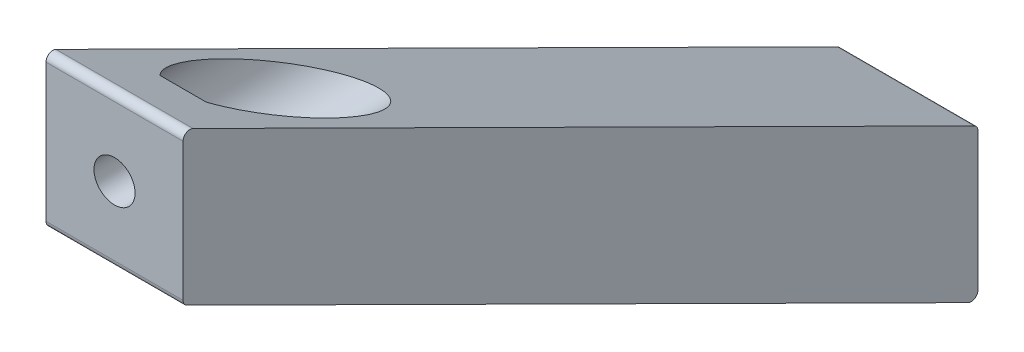
ISO-10303-21;
HEADER;
FILE_DESCRIPTION(('STEP AP214'),'2;1');
FILE_NAME('part.step','',(''),(''),'','','');
FILE_SCHEMA(('AUTOMOTIVE_DESIGN { 1 0 10303 214 1 1 1 1 }'));
ENDSEC;
DATA;
#1=APPLICATION_CONTEXT('core data for automotive mechanical design processes');
#2=APPLICATION_PROTOCOL_DEFINITION('international standard','automotive_design',2000,#1);
#3=PRODUCT_CONTEXT('',#1,'mechanical');
#4=PRODUCT('Part','Part','',(#3));
#5=PRODUCT_RELATED_PRODUCT_CATEGORY('part','',(#4));
#6=PRODUCT_DEFINITION_FORMATION('','',#4);
#7=PRODUCT_DEFINITION_CONTEXT('part definition',#1,'design');
#8=PRODUCT_DEFINITION('design','',#6,#7);
#9=PRODUCT_DEFINITION_SHAPE('','',#8);
#10=(LENGTH_UNIT() NAMED_UNIT(*) SI_UNIT(.MILLI.,.METRE.));
#11=(NAMED_UNIT(*) PLANE_ANGLE_UNIT() SI_UNIT($,.RADIAN.));
#12=(NAMED_UNIT(*) SI_UNIT($,.STERADIAN.) SOLID_ANGLE_UNIT());
#13=UNCERTAINTY_MEASURE_WITH_UNIT(LENGTH_MEASURE(1.E-05),#10,'distance_accuracy_value','');
#14=(GEOMETRIC_REPRESENTATION_CONTEXT(3) GLOBAL_UNCERTAINTY_ASSIGNED_CONTEXT((#13)) GLOBAL_UNIT_ASSIGNED_CONTEXT((#10,
#11,#12)) REPRESENTATION_CONTEXT('',''));
#15=CARTESIAN_POINT('',(0.,0.,0.));
#16=DIRECTION('',(0.,0.,1.));
#17=DIRECTION('',(1.,0.,0.));
#18=AXIS2_PLACEMENT_3D('',#15,#16,#17);
#19=CARTESIAN_POINT('',(20.,45.9089136836522,-115.));
#20=DIRECTION('',(-1.,0.,0.));
#21=DIRECTION('',(0.,0.,1.));
#22=AXIS2_PLACEMENT_3D('',#19,#20,#21);
#23=CYLINDRICAL_SURFACE('',#22,0.999999999999996);
#24=CARTESIAN_POINT('',(0.,45.9089136836522,-115.));
#25=DIRECTION('',(1.,0.,0.));
#26=DIRECTION('',(0.,0.,-1.));
#27=AXIS2_PLACEMENT_3D('',#24,#25,#26);
#28=CIRCLE('',#27,0.999999999999996);
#29=CARTESIAN_POINT('',(0.,45.0134547353029,-114.55485589769));
#30=VERTEX_POINT('',#29);
#31=CARTESIAN_POINT('',(0.,45.9089136836522,-116.));
#32=VERTEX_POINT('',#31);
#33=EDGE_CURVE('E153',#30,#32,#28,.T.);
#34=ORIENTED_EDGE('',*,*,#33,.T.);
#35=DIRECTION('',(-1.,0.,0.));
#36=VECTOR('',#35,1.);
#37=CARTESIAN_POINT('',(20.,45.9089136836522,-116.));
#38=LINE('',#37,#36);
#39=CARTESIAN_POINT('',(20.,45.9089136836522,-116.));
#40=VERTEX_POINT('',#39);
#41=EDGE_CURVE('E210',#40,#32,#38,.T.);
#42=ORIENTED_EDGE('',*,*,#41,.F.);
#43=CARTESIAN_POINT('',(20.,45.9089136836522,-115.));
#44=DIRECTION('',(1.,0.,0.));
#45=DIRECTION('',(0.,0.,-1.));
#46=AXIS2_PLACEMENT_3D('',#43,#44,#45);
#47=CIRCLE('',#46,0.999999999999996);
#48=CARTESIAN_POINT('',(20.,45.0134547353029,-114.55485589769));
#49=VERTEX_POINT('',#48);
#50=EDGE_CURVE('E147',#49,#40,#47,.T.);
#51=ORIENTED_EDGE('',*,*,#50,.F.);
#52=DIRECTION('',(-1.,0.,0.));
#53=VECTOR('',#52,1.);
#54=CARTESIAN_POINT('',(20.,45.0134547353029,-114.55485589769));
#55=LINE('',#54,#53);
#56=EDGE_CURVE('E139',#49,#30,#55,.T.);
#57=ORIENTED_EDGE('',*,*,#56,.T.);
#58=EDGE_LOOP('',(#34,#42,#51,#57));
#59=FACE_BOUND('',#58,.T.);
#60=ADVANCED_FACE('F41',(#59),#23,.T.);
#61=CARTESIAN_POINT('',(20.,45.9089136836522,-116.));
#62=DIRECTION('',(0.,0.,1.));
#63=DIRECTION('',(1.,0.,0.));
#64=AXIS2_PLACEMENT_3D('',#61,#62,#63);
#65=PLANE('',#64);
#66=CARTESIAN_POINT('',(10.,55.9596256862415,-116.));
#67=DIRECTION('',(0.,0.,-1.));
#68=DIRECTION('',(-1.,0.,0.));
#69=AXIS2_PLACEMENT_3D('',#66,#67,#68);
#70=CIRCLE('',#69,3.);
#71=CARTESIAN_POINT('',(7.,55.9596256862415,-116.));
#72=VERTEX_POINT('',#71);
#73=EDGE_CURVE('E120',#72,#72,#70,.T.);
#74=ORIENTED_EDGE('',*,*,#73,.F.);
#75=EDGE_LOOP('',(#74));
#76=FACE_BOUND('',#75,.T.);
#77=DIRECTION('',(0.,1.,0.));
#78=VECTOR('',#77,1.);
#79=CARTESIAN_POINT('',(0.,45.9089136836522,-116.));
#80=LINE('',#79,#78);
#81=CARTESIAN_POINT('',(0.,66.0103376888309,-116.));
#82=VERTEX_POINT('',#81);
#83=EDGE_CURVE('E160',#32,#82,#80,.T.);
#84=ORIENTED_EDGE('',*,*,#83,.T.);
#85=DIRECTION('',(-1.,0.,0.));
#86=VECTOR('',#85,1.);
#87=CARTESIAN_POINT('',(20.,66.0103376888309,-116.));
#88=LINE('',#87,#86);
#89=CARTESIAN_POINT('',(20.,66.0103376888309,-116.));
#90=VERTEX_POINT('',#89);
#91=EDGE_CURVE('E206',#90,#82,#88,.T.);
#92=ORIENTED_EDGE('',*,*,#91,.F.);
#93=DIRECTION('',(0.,1.,0.));
#94=VECTOR('',#93,1.);
#95=CARTESIAN_POINT('',(20.,45.9089136836522,-116.));
#96=LINE('',#95,#94);
#97=EDGE_CURVE('E396',#40,#90,#96,.T.);
#98=ORIENTED_EDGE('',*,*,#97,.F.);
#99=ORIENTED_EDGE('',*,*,#41,.T.);
#100=EDGE_LOOP('',(#84,#92,#98,#99));
#101=FACE_BOUND('',#100,.T.);
#102=ADVANCED_FACE('F233',(#76,#101),#65,.F.);
#103=CARTESIAN_POINT('',(20.,66.0103376888309,-115.));
#104=DIRECTION('',(-1.,0.,0.));
#105=DIRECTION('',(0.,0.,1.));
#106=AXIS2_PLACEMENT_3D('',#103,#104,#105);
#107=CYLINDRICAL_SURFACE('',#106,1.00000000000001);
#108=CARTESIAN_POINT('',(0.,66.0103376888309,-115.));
#109=DIRECTION('',(1.,0.,0.));
#110=DIRECTION('',(0.,0.,-1.));
#111=AXIS2_PLACEMENT_3D('',#108,#109,#110);
#112=CIRCLE('',#111,1.00000000000001);
#113=CARTESIAN_POINT('',(0.,66.9057966371802,-115.44514410231));
#114=VERTEX_POINT('',#113);
#115=EDGE_CURVE('E167',#82,#114,#112,.T.);
#116=ORIENTED_EDGE('',*,*,#115,.T.);
#117=DIRECTION('',(-1.,0.,0.));
#118=VECTOR('',#117,1.);
#119=CARTESIAN_POINT('',(20.,66.9057966371802,-115.44514410231));
#120=LINE('',#119,#118);
#121=CARTESIAN_POINT('',(20.,66.9057966371802,-115.44514410231));
#122=VERTEX_POINT('',#121);
#123=EDGE_CURVE('E202',#122,#114,#120,.T.);
#124=ORIENTED_EDGE('',*,*,#123,.F.);
#125=CARTESIAN_POINT('',(20.,66.0103376888309,-115.));
#126=DIRECTION('',(1.,0.,0.));
#127=DIRECTION('',(0.,0.,-1.));
#128=AXIS2_PLACEMENT_3D('',#125,#126,#127);
#129=CIRCLE('',#128,1.00000000000001);
#130=EDGE_CURVE('E393',#90,#122,#129,.T.);
#131=ORIENTED_EDGE('',*,*,#130,.F.);
#132=ORIENTED_EDGE('',*,*,#91,.T.);
#133=EDGE_LOOP('',(#116,#124,#131,#132));
#134=FACE_BOUND('',#133,.T.);
#135=ADVANCED_FACE('F237',(#134),#107,.T.);
#136=CARTESIAN_POINT('',(20.,66.9057966371802,-115.44514410231));
#137=DIRECTION('',(0.,-0.895458948349264,0.445144102309837));
#138=DIRECTION('',(0.,-0.445144102309837,-0.895458948349264));
#139=AXIS2_PLACEMENT_3D('',#136,#137,#138);
#140=PLANE('',#139);
#141=DIRECTION('',(-1.,0.,0.));
#142=VECTOR('',#141,1.);
#143=CARTESIAN_POINT('',(20.,119.323927139849,-9.99999999999999));
#144=LINE('',#143,#142);
#145=CARTESIAN_POINT('',(13.3834636165041,119.323927139849,-10.));
#146=VERTEX_POINT('',#145);
#147=CARTESIAN_POINT('',(6.61653638349591,119.323927139849,-10.));
#148=VERTEX_POINT('',#147);
#149=EDGE_CURVE('E170',#146,#148,#144,.T.);
#150=ORIENTED_EDGE('',*,*,#149,.T.);
#151=CARTESIAN_POINT('',(10.,112.630484531161,-23.4646354924402));
#152=DIRECTION('',(0.,-0.895458948349264,0.445144102309837));
#153=DIRECTION('',(0.,0.445144102309837,0.895458948349264));
#154=AXIS2_PLACEMENT_3D('',#151,#152,#153);
#155=ELLIPSE('',#154,16.8484766193302,7.5);
#156=EDGE_CURVE('E49',#148,#146,#155,.T.);
#157=ORIENTED_EDGE('',*,*,#156,.T.);
#158=EDGE_LOOP('',(#150,#157));
#159=FACE_BOUND('',#158,.T.);
#160=DIRECTION('',(0.,0.445144102309837,0.895458948349264));
#161=VECTOR('',#160,1.);
#162=CARTESIAN_POINT('',(0.,66.9057966371802,-115.44514410231));
#163=LINE('',#162,#161);
#164=CARTESIAN_POINT('',(0.,123.5766554821,-1.44514410230983));
#165=VERTEX_POINT('',#164);
#166=EDGE_CURVE('E177',#114,#165,#163,.T.);
#167=ORIENTED_EDGE('',*,*,#166,.T.);
#168=DIRECTION('',(-1.,0.,0.));
#169=VECTOR('',#168,1.);
#170=CARTESIAN_POINT('',(20.,123.5766554821,-1.44514410230983));
#171=LINE('',#170,#169);
#172=CARTESIAN_POINT('',(20.,123.5766554821,-1.44514410230983));
#173=VERTEX_POINT('',#172);
#174=EDGE_CURVE('E198',#173,#165,#171,.T.);
#175=ORIENTED_EDGE('',*,*,#174,.F.);
#176=DIRECTION('',(0.,0.445144102309837,0.895458948349264));
#177=VECTOR('',#176,1.);
#178=CARTESIAN_POINT('',(20.,66.9057966371802,-115.44514410231));
#179=LINE('',#178,#177);
#180=EDGE_CURVE('E390',#122,#173,#179,.T.);
#181=ORIENTED_EDGE('',*,*,#180,.F.);
#182=ORIENTED_EDGE('',*,*,#123,.T.);
#183=EDGE_LOOP('',(#167,#175,#181,#182));
#184=FACE_BOUND('',#183,.T.);
#185=ADVANCED_FACE('F242',(#159,#184),#140,.F.);
#186=CARTESIAN_POINT('',(20.,122.681196533751,-1.));
#187=DIRECTION('',(-1.,0.,0.));
#188=DIRECTION('',(0.,0.,1.));
#189=AXIS2_PLACEMENT_3D('',#186,#187,#188);
#190=CYLINDRICAL_SURFACE('',#189,0.999999999999994);
#191=CARTESIAN_POINT('',(0.,122.681196533751,-1.));
#192=DIRECTION('',(1.,0.,0.));
#193=DIRECTION('',(0.,0.,-1.));
#194=AXIS2_PLACEMENT_3D('',#191,#192,#193);
#195=CIRCLE('',#194,0.999999999999994);
#196=CARTESIAN_POINT('',(0.,122.681196533751,0.));
#197=VERTEX_POINT('',#196);
#198=EDGE_CURVE('E180',#165,#197,#195,.T.);
#199=ORIENTED_EDGE('',*,*,#198,.T.);
#200=DIRECTION('',(-1.,0.,0.));
#201=VECTOR('',#200,1.);
#202=CARTESIAN_POINT('',(20.,122.681196533751,0.));
#203=LINE('',#202,#201);
#204=CARTESIAN_POINT('',(20.,122.681196533751,0.));
#205=VERTEX_POINT('',#204);
#206=EDGE_CURVE('E194',#205,#197,#203,.T.);
#207=ORIENTED_EDGE('',*,*,#206,.F.);
#208=CARTESIAN_POINT('',(20.,122.681196533751,-1.));
#209=DIRECTION('',(1.,0.,0.));
#210=DIRECTION('',(0.,0.,-1.));
#211=AXIS2_PLACEMENT_3D('',#208,#209,#210);
#212=CIRCLE('',#211,0.999999999999994);
#213=EDGE_CURVE('E385',#173,#205,#212,.T.);
#214=ORIENTED_EDGE('',*,*,#213,.F.);
#215=ORIENTED_EDGE('',*,*,#174,.T.);
#216=EDGE_LOOP('',(#199,#207,#214,#215));
#217=FACE_BOUND('',#216,.T.);
#218=ADVANCED_FACE('F250',(#217),#190,.T.);
#219=CARTESIAN_POINT('',(20.,122.681196533751,0.));
#220=DIRECTION('',(0.,0.,-1.));
#221=DIRECTION('',(0.,1.,0.));
#222=AXIS2_PLACEMENT_3D('',#219,#220,#221);
#223=PLANE('',#222);
#224=CARTESIAN_POINT('',(10.,112.630484531161,0.));
#225=DIRECTION('',(0.,0.,1.));
#226=DIRECTION('',(1.,0.,0.));
#227=AXIS2_PLACEMENT_3D('',#224,#225,#226);
#228=CIRCLE('',#227,3.);
#229=CARTESIAN_POINT('',(13.,112.630484531161,0.));
#230=VERTEX_POINT('',#229);
#231=EDGE_CURVE('E163',#230,#230,#228,.T.);
#232=ORIENTED_EDGE('',*,*,#231,.F.);
#233=EDGE_LOOP('',(#232));
#234=FACE_BOUND('',#233,.T.);
#235=DIRECTION('',(0.,-1.,0.));
#236=VECTOR('',#235,1.);
#237=CARTESIAN_POINT('',(0.,122.681196533751,0.));
#238=LINE('',#237,#236);
#239=CARTESIAN_POINT('',(0.,102.579772528572,0.));
#240=VERTEX_POINT('',#239);
#241=EDGE_CURVE('E183',#197,#240,#238,.T.);
#242=ORIENTED_EDGE('',*,*,#241,.T.);
#243=DIRECTION('',(-1.,0.,0.));
#244=VECTOR('',#243,1.);
#245=CARTESIAN_POINT('',(20.,102.579772528572,0.));
#246=LINE('',#245,#244);
#247=CARTESIAN_POINT('',(20.,102.579772528572,0.));
#248=VERTEX_POINT('',#247);
#249=EDGE_CURVE('E190',#248,#240,#246,.T.);
#250=ORIENTED_EDGE('',*,*,#249,.F.);
#251=DIRECTION('',(0.,-1.,0.));
#252=VECTOR('',#251,1.);
#253=CARTESIAN_POINT('',(20.,122.681196533751,0.));
#254=LINE('',#253,#252);
#255=EDGE_CURVE('E382',#205,#248,#254,.T.);
#256=ORIENTED_EDGE('',*,*,#255,.F.);
#257=ORIENTED_EDGE('',*,*,#206,.T.);
#258=EDGE_LOOP('',(#242,#250,#256,#257));
#259=FACE_BOUND('',#258,.T.);
#260=ADVANCED_FACE('F254',(#234,#259),#223,.F.);
#261=CARTESIAN_POINT('',(20.,102.579772528572,-0.999999999999997));
#262=DIRECTION('',(-1.,0.,0.));
#263=DIRECTION('',(0.,0.,1.));
#264=AXIS2_PLACEMENT_3D('',#261,#262,#263);
#265=CYLINDRICAL_SURFACE('',#264,0.999999999999999);
#266=CARTESIAN_POINT('',(0.,102.579772528572,-0.999999999999997));
#267=DIRECTION('',(1.,0.,0.));
#268=DIRECTION('',(0.,0.,-1.));
#269=AXIS2_PLACEMENT_3D('',#266,#267,#268);
#270=CIRCLE('',#269,0.999999999999999);
#271=CARTESIAN_POINT('',(0.,101.684313580223,-0.554855897690158));
#272=VERTEX_POINT('',#271);
#273=EDGE_CURVE('E148',#240,#272,#270,.T.);
#274=ORIENTED_EDGE('',*,*,#273,.T.);
#275=DIRECTION('',(-1.,0.,0.));
#276=VECTOR('',#275,1.);
#277=CARTESIAN_POINT('',(20.,101.684313580223,-0.554855897690158));
#278=LINE('',#277,#276);
#279=CARTESIAN_POINT('',(20.,101.684313580223,-0.554855897690158));
#280=VERTEX_POINT('',#279);
#281=EDGE_CURVE('E142',#280,#272,#278,.T.);
#282=ORIENTED_EDGE('',*,*,#281,.F.);
#283=CARTESIAN_POINT('',(20.,102.579772528572,-0.999999999999997));
#284=DIRECTION('',(1.,0.,0.));
#285=DIRECTION('',(0.,0.,-1.));
#286=AXIS2_PLACEMENT_3D('',#283,#284,#285);
#287=CIRCLE('',#286,0.999999999999999);
#288=EDGE_CURVE('E380',#248,#280,#287,.T.);
#289=ORIENTED_EDGE('',*,*,#288,.F.);
#290=ORIENTED_EDGE('',*,*,#249,.T.);
#291=EDGE_LOOP('',(#274,#282,#289,#290));
#292=FACE_BOUND('',#291,.T.);
#293=ADVANCED_FACE('F131',(#292),#265,.T.);
#294=CARTESIAN_POINT('',(20.,101.684313580223,-0.554855897690158));
#295=DIRECTION('',(0.,0.895458948349264,-0.445144102309837));
#296=DIRECTION('',(0.,0.445144102309837,0.895458948349264));
#297=AXIS2_PLACEMENT_3D('',#294,#295,#296);
#298=PLANE('',#297);
#299=DIRECTION('',(-1.,0.,0.));
#300=VECTOR('',#299,1.);
#301=CARTESIAN_POINT('',(20.,49.266183077554,-106.));
#302=LINE('',#301,#300);
#303=CARTESIAN_POINT('',(13.3834636165041,49.266183077554,-106.));
#304=VERTEX_POINT('',#303);
#305=CARTESIAN_POINT('',(6.61653638349594,49.266183077554,-106.));
#306=VERTEX_POINT('',#305);
#307=EDGE_CURVE('E116',#304,#306,#302,.T.);
#308=ORIENTED_EDGE('',*,*,#307,.T.);
#309=CARTESIAN_POINT('',(10.,55.9596256862415,-92.5353645075598));
#310=DIRECTION('',(0.,0.895458948349264,-0.445144102309837));
#311=DIRECTION('',(0.,-0.445144102309837,-0.895458948349264));
#312=AXIS2_PLACEMENT_3D('',#309,#310,#311);
#313=ELLIPSE('',#312,16.8484766193301,7.5);
#314=EDGE_CURVE('E11',#306,#304,#313,.T.);
#315=ORIENTED_EDGE('',*,*,#314,.T.);
#316=EDGE_LOOP('',(#308,#315));
#317=FACE_BOUND('',#316,.T.);
#318=DIRECTION('',(0.,-0.445144102309837,-0.895458948349264));
#319=VECTOR('',#318,1.);
#320=CARTESIAN_POINT('',(0.,101.684313580223,-0.554855897690158));
#321=LINE('',#320,#319);
#322=EDGE_CURVE('E136',#272,#30,#321,.T.);
#323=ORIENTED_EDGE('',*,*,#322,.T.);
#324=ORIENTED_EDGE('',*,*,#56,.F.);
#325=DIRECTION('',(0.,-0.445144102309837,-0.895458948349264));
#326=VECTOR('',#325,1.);
#327=CARTESIAN_POINT('',(20.,101.684313580223,-0.554855897690158));
#328=LINE('',#327,#326);
#329=EDGE_CURVE('E156',#280,#49,#328,.T.);
#330=ORIENTED_EDGE('',*,*,#329,.F.);
#331=ORIENTED_EDGE('',*,*,#281,.T.);
#332=EDGE_LOOP('',(#323,#324,#330,#331));
#333=FACE_BOUND('',#332,.T.);
#334=ADVANCED_FACE('F127',(#317,#333),#298,.F.);
#335=CARTESIAN_POINT('',(20.,45.9089136836522,-115.));
#336=DIRECTION('',(1.,0.,0.));
#337=DIRECTION('',(0.,0.,-1.));
#338=AXIS2_PLACEMENT_3D('',#335,#336,#337);
#339=PLANE('',#338);
#340=ORIENTED_EDGE('',*,*,#50,.T.);
#341=ORIENTED_EDGE('',*,*,#97,.T.);
#342=ORIENTED_EDGE('',*,*,#130,.T.);
#343=ORIENTED_EDGE('',*,*,#180,.T.);
#344=ORIENTED_EDGE('',*,*,#213,.T.);
#345=ORIENTED_EDGE('',*,*,#255,.T.);
#346=ORIENTED_EDGE('',*,*,#288,.T.);
#347=ORIENTED_EDGE('',*,*,#329,.T.);
#348=EDGE_LOOP('',(#340,#341,#342,#343,#344,#345,#346,#347));
#349=FACE_BOUND('',#348,.T.);
#350=ADVANCED_FACE('F130',(#349),#339,.T.);
#351=CARTESIAN_POINT('',(0.,45.9089136836522,-115.));
#352=DIRECTION('',(1.,0.,0.));
#353=DIRECTION('',(0.,0.,-1.));
#354=AXIS2_PLACEMENT_3D('',#351,#352,#353);
#355=PLANE('',#354);
#356=ORIENTED_EDGE('',*,*,#33,.F.);
#357=ORIENTED_EDGE('',*,*,#322,.F.);
#358=ORIENTED_EDGE('',*,*,#273,.F.);
#359=ORIENTED_EDGE('',*,*,#241,.F.);
#360=ORIENTED_EDGE('',*,*,#198,.F.);
#361=ORIENTED_EDGE('',*,*,#166,.F.);
#362=ORIENTED_EDGE('',*,*,#115,.F.);
#363=ORIENTED_EDGE('',*,*,#83,.F.);
#364=EDGE_LOOP('',(#356,#357,#358,#359,#360,#361,#362,#363));
#365=FACE_BOUND('',#364,.T.);
#366=ADVANCED_FACE('F158',(#365),#355,.F.);
#367=CARTESIAN_POINT('',(10.,112.630484531161,-116.));
#368=DIRECTION('',(0.,0.,1.));
#369=DIRECTION('',(1.,0.,0.));
#370=AXIS2_PLACEMENT_3D('',#367,#368,#369);
#371=CYLINDRICAL_SURFACE('',#370,3.);
#372=CARTESIAN_POINT('',(10.,112.630484531161,-9.99999999999999));
#373=DIRECTION('',(0.,0.,1.));
#374=DIRECTION('',(1.,0.,0.));
#375=AXIS2_PLACEMENT_3D('',#372,#373,#374);
#376=CIRCLE('',#375,3.);
#377=CARTESIAN_POINT('',(13.,112.630484531161,-9.99999999999999));
#378=VERTEX_POINT('',#377);
#379=EDGE_CURVE('E213',#378,#378,#376,.F.);
#380=ORIENTED_EDGE('',*,*,#379,.T.);
#381=EDGE_LOOP('',(#380));
#382=FACE_BOUND('',#381,.T.);
#383=ORIENTED_EDGE('',*,*,#231,.T.);
#384=EDGE_LOOP('',(#383));
#385=FACE_BOUND('',#384,.T.);
#386=ADVANCED_FACE('F264',(#382,#385),#371,.F.);
#387=CARTESIAN_POINT('',(10.,112.630484531161,-116.));
#388=DIRECTION('',(0.,0.,1.));
#389=DIRECTION('',(1.,0.,0.));
#390=AXIS2_PLACEMENT_3D('',#387,#388,#389);
#391=CYLINDRICAL_SURFACE('',#390,7.5);
#392=CARTESIAN_POINT('',(10.,112.630484531161,-10.));
#393=DIRECTION('',(0.,0.,1.));
#394=DIRECTION('',(1.,0.,0.));
#395=AXIS2_PLACEMENT_3D('',#392,#393,#394);
#396=CIRCLE('',#395,7.5);
#397=EDGE_CURVE('E62',#148,#146,#396,.T.);
#398=ORIENTED_EDGE('',*,*,#397,.T.);
#399=ORIENTED_EDGE('',*,*,#156,.F.);
#400=EDGE_LOOP('',(#398,#399));
#401=FACE_BOUND('',#400,.T.);
#402=ADVANCED_FACE('F270',(#401),#391,.F.);
#403=CARTESIAN_POINT('',(10.,112.630484531161,-10.));
#404=DIRECTION('',(0.,0.,1.));
#405=DIRECTION('',(1.,0.,0.));
#406=AXIS2_PLACEMENT_3D('',#403,#404,#405);
#407=PLANE('',#406);
#408=ORIENTED_EDGE('',*,*,#379,.F.);
#409=EDGE_LOOP('',(#408));
#410=FACE_BOUND('',#409,.T.);
#411=ORIENTED_EDGE('',*,*,#397,.F.);
#412=ORIENTED_EDGE('',*,*,#149,.F.);
#413=EDGE_LOOP('',(#411,#412));
#414=FACE_BOUND('',#413,.T.);
#415=ADVANCED_FACE('F274',(#410,#414),#407,.F.);
#416=CARTESIAN_POINT('',(10.,55.9596256862415,0.));
#417=DIRECTION('',(0.,0.,-1.));
#418=DIRECTION('',(-1.,0.,0.));
#419=AXIS2_PLACEMENT_3D('',#416,#417,#418);
#420=CYLINDRICAL_SURFACE('',#419,3.);
#421=CARTESIAN_POINT('',(10.,55.9596256862415,-106.));
#422=DIRECTION('',(0.,0.,-1.));
#423=DIRECTION('',(-1.,0.,0.));
#424=AXIS2_PLACEMENT_3D('',#421,#422,#423);
#425=CIRCLE('',#424,3.);
#426=CARTESIAN_POINT('',(7.,55.9596256862415,-106.));
#427=VERTEX_POINT('',#426);
#428=EDGE_CURVE('E121',#427,#427,#425,.F.);
#429=ORIENTED_EDGE('',*,*,#428,.T.);
#430=EDGE_LOOP('',(#429));
#431=FACE_BOUND('',#430,.T.);
#432=ORIENTED_EDGE('',*,*,#73,.T.);
#433=EDGE_LOOP('',(#432));
#434=FACE_BOUND('',#433,.T.);
#435=ADVANCED_FACE('F223',(#431,#434),#420,.F.);
#436=CARTESIAN_POINT('',(10.,55.9596256862415,0.));
#437=DIRECTION('',(0.,0.,-1.));
#438=DIRECTION('',(-1.,0.,0.));
#439=AXIS2_PLACEMENT_3D('',#436,#437,#438);
#440=CYLINDRICAL_SURFACE('',#439,7.5);
#441=CARTESIAN_POINT('',(10.,55.9596256862415,-106.));
#442=DIRECTION('',(0.,0.,-1.));
#443=DIRECTION('',(-1.,0.,0.));
#444=AXIS2_PLACEMENT_3D('',#441,#442,#443);
#445=CIRCLE('',#444,7.5);
#446=EDGE_CURVE('E55',#306,#304,#445,.T.);
#447=ORIENTED_EDGE('',*,*,#446,.T.);
#448=ORIENTED_EDGE('',*,*,#314,.F.);
#449=EDGE_LOOP('',(#447,#448));
#450=FACE_BOUND('',#449,.T.);
#451=ADVANCED_FACE('F124',(#450),#440,.F.);
#452=CARTESIAN_POINT('',(10.,55.9596256862415,-106.));
#453=DIRECTION('',(0.,0.,-1.));
#454=DIRECTION('',(-1.,0.,0.));
#455=AXIS2_PLACEMENT_3D('',#452,#453,#454);
#456=PLANE('',#455);
#457=ORIENTED_EDGE('',*,*,#428,.F.);
#458=EDGE_LOOP('',(#457));
#459=FACE_BOUND('',#458,.T.);
#460=ORIENTED_EDGE('',*,*,#446,.F.);
#461=ORIENTED_EDGE('',*,*,#307,.F.);
#462=EDGE_LOOP('',(#460,#461));
#463=FACE_BOUND('',#462,.T.);
#464=ADVANCED_FACE('F117',(#459,#463),#456,.F.);
#465=CLOSED_SHELL('',(#60,#102,#135,#185,#218,#260,#293,#334,#350,#366,#386,#402,#415,#435,#451,#464));
#466=MANIFOLD_SOLID_BREP('B2',#465);
#467=ADVANCED_BREP_SHAPE_REPRESENTATION('',(#18,#466),#14);
#468=SHAPE_DEFINITION_REPRESENTATION(#9,#467);
ENDSEC;
END-ISO-10303-21;
